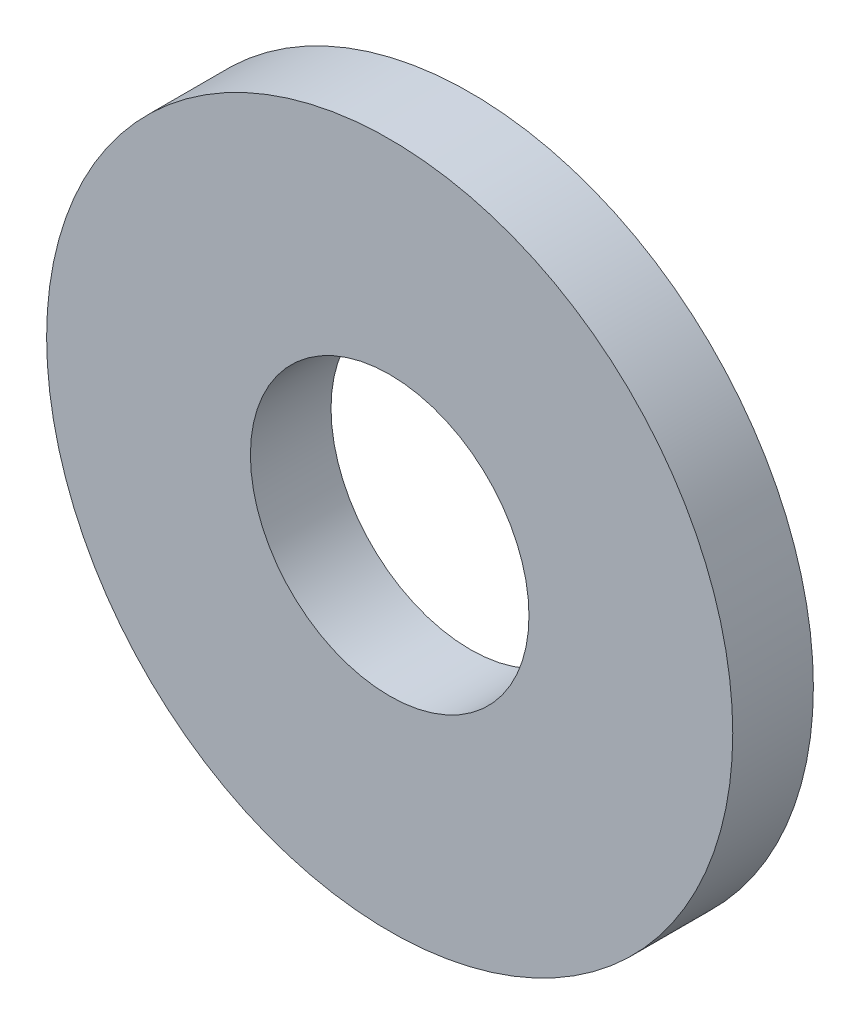
ISO-10303-21;
HEADER;
FILE_DESCRIPTION(('STEP AP214'),'2;1');
FILE_NAME('part.step','',(''),(''),'','','');
FILE_SCHEMA(('AUTOMOTIVE_DESIGN { 1 0 10303 214 1 1 1 1 }'));
ENDSEC;
DATA;
#1=APPLICATION_CONTEXT('core data for automotive mechanical design processes');
#2=APPLICATION_PROTOCOL_DEFINITION('international standard','automotive_design',2000,#1);
#3=PRODUCT_CONTEXT('',#1,'mechanical');
#4=PRODUCT('Part','Part','',(#3));
#5=PRODUCT_RELATED_PRODUCT_CATEGORY('part','',(#4));
#6=PRODUCT_DEFINITION_FORMATION('','',#4);
#7=PRODUCT_DEFINITION_CONTEXT('part definition',#1,'design');
#8=PRODUCT_DEFINITION('design','',#6,#7);
#9=PRODUCT_DEFINITION_SHAPE('','',#8);
#10=(LENGTH_UNIT() NAMED_UNIT(*) SI_UNIT(.MILLI.,.METRE.));
#11=(NAMED_UNIT(*) PLANE_ANGLE_UNIT() SI_UNIT($,.RADIAN.));
#12=(NAMED_UNIT(*) SI_UNIT($,.STERADIAN.) SOLID_ANGLE_UNIT());
#13=UNCERTAINTY_MEASURE_WITH_UNIT(LENGTH_MEASURE(1.E-05),#10,'distance_accuracy_value','');
#14=(GEOMETRIC_REPRESENTATION_CONTEXT(3) GLOBAL_UNCERTAINTY_ASSIGNED_CONTEXT((#13)) GLOBAL_UNIT_ASSIGNED_CONTEXT((#10,
#11,#12)) REPRESENTATION_CONTEXT('',''));
#15=CARTESIAN_POINT('',(0.,0.,0.));
#16=DIRECTION('',(0.,0.,1.));
#17=DIRECTION('',(1.,0.,0.));
#18=AXIS2_PLACEMENT_3D('',#15,#16,#17);
#19=CARTESIAN_POINT('',(0.,0.,1.49225));
#20=DIRECTION('',(0.,0.,1.));
#21=DIRECTION('',(1.,0.,0.));
#22=AXIS2_PLACEMENT_3D('',#19,#20,#21);
#23=PLANE('',#22);
#24=CARTESIAN_POINT('',(0.,0.,1.49225));
#25=DIRECTION('',(0.,0.,1.));
#26=DIRECTION('',(1.,0.,0.));
#27=AXIS2_PLACEMENT_3D('',#24,#25,#26);
#28=CIRCLE('',#27,12.7);
#29=CARTESIAN_POINT('',(12.7,0.,1.49225));
#30=VERTEX_POINT('',#29);
#31=EDGE_CURVE('E10',#30,#30,#28,.T.);
#32=ORIENTED_EDGE('',*,*,#31,.T.);
#33=EDGE_LOOP('',(#32));
#34=FACE_BOUND('',#33,.T.);
#35=CARTESIAN_POINT('',(0.,0.,1.49225));
#36=DIRECTION('',(0.,0.,1.));
#37=DIRECTION('',(1.,0.,0.));
#38=AXIS2_PLACEMENT_3D('',#35,#36,#37);
#39=CIRCLE('',#38,5.1562);
#40=CARTESIAN_POINT('',(5.1562,0.,1.49225));
#41=VERTEX_POINT('',#40);
#42=EDGE_CURVE('E41',#41,#41,#39,.T.);
#43=ORIENTED_EDGE('',*,*,#42,.F.);
#44=EDGE_LOOP('',(#43));
#45=FACE_BOUND('',#44,.T.);
#46=ADVANCED_FACE('F30',(#34,#45),#23,.T.);
#47=CARTESIAN_POINT('',(0.,0.,-1.49225));
#48=DIRECTION('',(0.,0.,1.));
#49=DIRECTION('',(1.,0.,0.));
#50=AXIS2_PLACEMENT_3D('',#47,#48,#49);
#51=PLANE('',#50);
#52=CARTESIAN_POINT('',(0.,0.,-1.49225));
#53=DIRECTION('',(0.,0.,1.));
#54=DIRECTION('',(1.,0.,0.));
#55=AXIS2_PLACEMENT_3D('',#52,#53,#54);
#56=CIRCLE('',#55,12.7);
#57=CARTESIAN_POINT('',(12.7,0.,-1.49225));
#58=VERTEX_POINT('',#57);
#59=EDGE_CURVE('E34',#58,#58,#56,.T.);
#60=ORIENTED_EDGE('',*,*,#59,.F.);
#61=EDGE_LOOP('',(#60));
#62=FACE_BOUND('',#61,.T.);
#63=CARTESIAN_POINT('',(0.,0.,-1.49225));
#64=DIRECTION('',(0.,0.,1.));
#65=DIRECTION('',(1.,0.,0.));
#66=AXIS2_PLACEMENT_3D('',#63,#64,#65);
#67=CIRCLE('',#66,5.1562);
#68=CARTESIAN_POINT('',(5.1562,0.,-1.49225));
#69=VERTEX_POINT('',#68);
#70=EDGE_CURVE('E43',#69,#69,#67,.T.);
#71=ORIENTED_EDGE('',*,*,#70,.T.);
#72=EDGE_LOOP('',(#71));
#73=FACE_BOUND('',#72,.T.);
#74=ADVANCED_FACE('F53',(#62,#73),#51,.F.);
#75=CARTESIAN_POINT('',(0.,0.,1.49225));
#76=DIRECTION('',(0.,0.,-1.));
#77=DIRECTION('',(-1.,0.,0.));
#78=AXIS2_PLACEMENT_3D('',#75,#76,#77);
#79=CYLINDRICAL_SURFACE('',#78,12.7);
#80=ORIENTED_EDGE('',*,*,#31,.F.);
#81=EDGE_LOOP('',(#80));
#82=FACE_BOUND('',#81,.T.);
#83=ORIENTED_EDGE('',*,*,#59,.T.);
#84=EDGE_LOOP('',(#83));
#85=FACE_BOUND('',#84,.T.);
#86=ADVANCED_FACE('F32',(#82,#85),#79,.T.);
#87=CARTESIAN_POINT('',(0.,0.,1.49225));
#88=DIRECTION('',(0.,0.,-1.));
#89=DIRECTION('',(-1.,0.,0.));
#90=AXIS2_PLACEMENT_3D('',#87,#88,#89);
#91=CYLINDRICAL_SURFACE('',#90,5.1562);
#92=ORIENTED_EDGE('',*,*,#42,.T.);
#93=EDGE_LOOP('',(#92));
#94=FACE_BOUND('',#93,.T.);
#95=ORIENTED_EDGE('',*,*,#70,.F.);
#96=EDGE_LOOP('',(#95));
#97=FACE_BOUND('',#96,.T.);
#98=ADVANCED_FACE('F49',(#94,#97),#91,.F.);
#99=CLOSED_SHELL('',(#46,#74,#86,#98));
#100=MANIFOLD_SOLID_BREP('B2',#99);
#101=ADVANCED_BREP_SHAPE_REPRESENTATION('',(#18,#100),#14);
#102=SHAPE_DEFINITION_REPRESENTATION(#9,#101);
ENDSEC;
END-ISO-10303-21;
